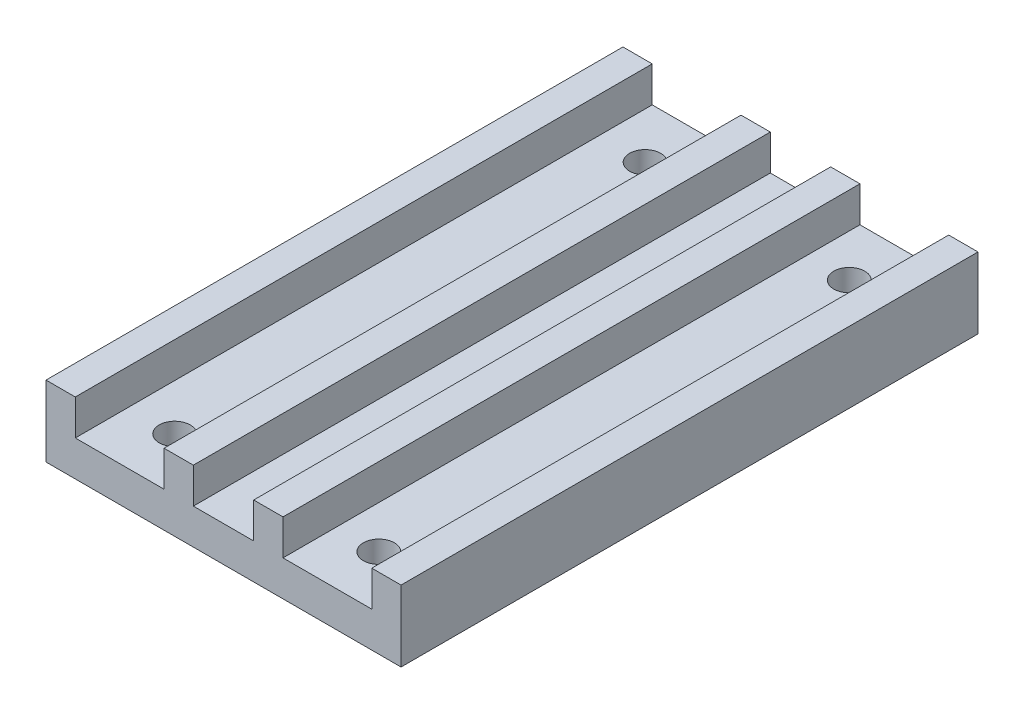
ISO-10303-21;
HEADER;
FILE_DESCRIPTION(('STEP AP214'),'2;1');
FILE_NAME('part.step','',(''),(''),'','','');
FILE_SCHEMA(('AUTOMOTIVE_DESIGN { 1 0 10303 214 1 1 1 1 }'));
ENDSEC;
DATA;
#1=APPLICATION_CONTEXT('core data for automotive mechanical design processes');
#2=APPLICATION_PROTOCOL_DEFINITION('international standard','automotive_design',2000,#1);
#3=PRODUCT_CONTEXT('',#1,'mechanical');
#4=PRODUCT('Part','Part','',(#3));
#5=PRODUCT_RELATED_PRODUCT_CATEGORY('part','',(#4));
#6=PRODUCT_DEFINITION_FORMATION('','',#4);
#7=PRODUCT_DEFINITION_CONTEXT('part definition',#1,'design');
#8=PRODUCT_DEFINITION('design','',#6,#7);
#9=PRODUCT_DEFINITION_SHAPE('','',#8);
#10=(LENGTH_UNIT() NAMED_UNIT(*) SI_UNIT(.MILLI.,.METRE.));
#11=(NAMED_UNIT(*) PLANE_ANGLE_UNIT() SI_UNIT($,.RADIAN.));
#12=(NAMED_UNIT(*) SI_UNIT($,.STERADIAN.) SOLID_ANGLE_UNIT());
#13=UNCERTAINTY_MEASURE_WITH_UNIT(LENGTH_MEASURE(1.E-05),#10,'distance_accuracy_value','');
#14=(GEOMETRIC_REPRESENTATION_CONTEXT(3) GLOBAL_UNCERTAINTY_ASSIGNED_CONTEXT((#13)) GLOBAL_UNIT_ASSIGNED_CONTEXT((#10,
#11,#12)) REPRESENTATION_CONTEXT('',''));
#15=CARTESIAN_POINT('',(0.,0.,0.));
#16=DIRECTION('',(0.,0.,1.));
#17=DIRECTION('',(1.,0.,0.));
#18=AXIS2_PLACEMENT_3D('',#15,#16,#17);
#19=CARTESIAN_POINT('',(0.,4.,0.));
#20=DIRECTION('',(0.,-1.,0.));
#21=DIRECTION('',(0.,0.,-1.));
#22=AXIS2_PLACEMENT_3D('',#19,#20,#21);
#23=PLANE('',#22);
#24=DIRECTION('',(0.,0.,1.));
#25=VECTOR('',#24,1.);
#26=CARTESIAN_POINT('',(3.4,4.,-32.5));
#27=LINE('',#26,#25);
#28=CARTESIAN_POINT('',(3.4,4.,-32.5));
#29=VERTEX_POINT('',#28);
#30=CARTESIAN_POINT('',(3.4,4.,32.5));
#31=VERTEX_POINT('',#30);
#32=EDGE_CURVE('E55',#29,#31,#27,.T.);
#33=ORIENTED_EDGE('',*,*,#32,.F.);
#34=DIRECTION('',(-1.,0.,0.));
#35=VECTOR('',#34,1.);
#36=CARTESIAN_POINT('',(-20.,4.,-32.5));
#37=LINE('',#36,#35);
#38=CARTESIAN_POINT('',(-3.39999999999999,4.,-32.5));
#39=VERTEX_POINT('',#38);
#40=EDGE_CURVE('E310',#29,#39,#37,.T.);
#41=ORIENTED_EDGE('',*,*,#40,.T.);
#42=DIRECTION('',(0.,0.,-1.));
#43=VECTOR('',#42,1.);
#44=CARTESIAN_POINT('',(-3.4,4.,-32.5));
#45=LINE('',#44,#43);
#46=CARTESIAN_POINT('',(-3.39999999999999,4.,32.5));
#47=VERTEX_POINT('',#46);
#48=EDGE_CURVE('E184',#47,#39,#45,.T.);
#49=ORIENTED_EDGE('',*,*,#48,.F.);
#50=DIRECTION('',(1.,0.,0.));
#51=VECTOR('',#50,1.);
#52=CARTESIAN_POINT('',(-20.,4.,32.5));
#53=LINE('',#52,#51);
#54=EDGE_CURVE('E316',#47,#31,#53,.T.);
#55=ORIENTED_EDGE('',*,*,#54,.T.);
#56=EDGE_LOOP('',(#33,#41,#49,#55));
#57=FACE_BOUND('',#56,.T.);
#58=ADVANCED_FACE('F39',(#57),#23,.F.);
#59=CARTESIAN_POINT('',(11.5,4.,26.5));
#60=DIRECTION('',(0.,1.,0.));
#61=DIRECTION('',(0.,0.,1.));
#62=AXIS2_PLACEMENT_3D('',#59,#60,#61);
#63=CIRCLE('',#62,1.75);
#64=CARTESIAN_POINT('',(11.5,4.,28.25));
#65=VERTEX_POINT('',#64);
#66=EDGE_CURVE('E299',#65,#65,#63,.T.);
#67=ORIENTED_EDGE('',*,*,#66,.F.);
#68=EDGE_LOOP('',(#67));
#69=FACE_BOUND('',#68,.T.);
#70=CARTESIAN_POINT('',(11.5,4.,-26.5));
#71=DIRECTION('',(0.,1.,0.));
#72=DIRECTION('',(0.,0.,-1.));
#73=AXIS2_PLACEMENT_3D('',#70,#71,#72);
#74=CIRCLE('',#73,1.75);
#75=CARTESIAN_POINT('',(11.5,4.,-28.25));
#76=VERTEX_POINT('',#75);
#77=EDGE_CURVE('E283',#76,#76,#74,.T.);
#78=ORIENTED_EDGE('',*,*,#77,.F.);
#79=EDGE_LOOP('',(#78));
#80=FACE_BOUND('',#79,.T.);
#81=DIRECTION('',(0.,0.,-1.));
#82=VECTOR('',#81,1.);
#83=CARTESIAN_POINT('',(6.7,4.,-32.5));
#84=LINE('',#83,#82);
#85=CARTESIAN_POINT('',(6.70000000000001,4.,32.5));
#86=VERTEX_POINT('',#85);
#87=CARTESIAN_POINT('',(6.70000000000001,4.,-32.5));
#88=VERTEX_POINT('',#87);
#89=EDGE_CURVE('E175',#86,#88,#84,.T.);
#90=ORIENTED_EDGE('',*,*,#89,.F.);
#91=CARTESIAN_POINT('',(16.7,4.,32.5));
#92=VERTEX_POINT('',#91);
#93=EDGE_CURVE('E309',#86,#92,#53,.T.);
#94=ORIENTED_EDGE('',*,*,#93,.T.);
#95=DIRECTION('',(0.,0.,1.));
#96=VECTOR('',#95,1.);
#97=CARTESIAN_POINT('',(16.7,4.,-32.5));
#98=LINE('',#97,#96);
#99=CARTESIAN_POINT('',(16.7,4.,-32.5));
#100=VERTEX_POINT('',#99);
#101=EDGE_CURVE('E222',#100,#92,#98,.T.);
#102=ORIENTED_EDGE('',*,*,#101,.F.);
#103=EDGE_CURVE('E63',#100,#88,#37,.T.);
#104=ORIENTED_EDGE('',*,*,#103,.T.);
#105=EDGE_LOOP('',(#90,#94,#102,#104));
#106=FACE_BOUND('',#105,.T.);
#107=ADVANCED_FACE('F360',(#69,#80,#106),#23,.F.);
#108=CARTESIAN_POINT('',(-11.5,4.,-26.5));
#109=DIRECTION('',(0.,1.,0.));
#110=DIRECTION('',(0.,0.,1.));
#111=AXIS2_PLACEMENT_3D('',#108,#109,#110);
#112=CIRCLE('',#111,1.75);
#113=CARTESIAN_POINT('',(-11.5,4.,-24.75));
#114=VERTEX_POINT('',#113);
#115=EDGE_CURVE('E275',#114,#114,#112,.T.);
#116=ORIENTED_EDGE('',*,*,#115,.F.);
#117=EDGE_LOOP('',(#116));
#118=FACE_BOUND('',#117,.T.);
#119=CARTESIAN_POINT('',(-11.5,4.,26.5));
#120=DIRECTION('',(0.,1.,0.));
#121=DIRECTION('',(0.,0.,-1.));
#122=AXIS2_PLACEMENT_3D('',#119,#120,#121);
#123=CIRCLE('',#122,1.75);
#124=CARTESIAN_POINT('',(-11.5,4.,24.75));
#125=VERTEX_POINT('',#124);
#126=EDGE_CURVE('E291',#125,#125,#123,.T.);
#127=ORIENTED_EDGE('',*,*,#126,.F.);
#128=EDGE_LOOP('',(#127));
#129=FACE_BOUND('',#128,.T.);
#130=DIRECTION('',(0.,0.,1.));
#131=VECTOR('',#130,1.);
#132=CARTESIAN_POINT('',(-6.7,4.,-32.5));
#133=LINE('',#132,#131);
#134=CARTESIAN_POINT('',(-6.7,4.,-32.5));
#135=VERTEX_POINT('',#134);
#136=CARTESIAN_POINT('',(-6.7,4.,32.5));
#137=VERTEX_POINT('',#136);
#138=EDGE_CURVE('E179',#135,#137,#133,.T.);
#139=ORIENTED_EDGE('',*,*,#138,.F.);
#140=CARTESIAN_POINT('',(-16.7,4.,-32.5));
#141=VERTEX_POINT('',#140);
#142=EDGE_CURVE('E311',#135,#141,#37,.T.);
#143=ORIENTED_EDGE('',*,*,#142,.T.);
#144=DIRECTION('',(0.,0.,-1.));
#145=VECTOR('',#144,1.);
#146=CARTESIAN_POINT('',(-16.7,4.,-32.5));
#147=LINE('',#146,#145);
#148=CARTESIAN_POINT('',(-16.7,4.,32.5));
#149=VERTEX_POINT('',#148);
#150=EDGE_CURVE('E248',#149,#141,#147,.T.);
#151=ORIENTED_EDGE('',*,*,#150,.F.);
#152=EDGE_CURVE('E312',#149,#137,#53,.T.);
#153=ORIENTED_EDGE('',*,*,#152,.T.);
#154=EDGE_LOOP('',(#139,#143,#151,#153));
#155=FACE_BOUND('',#154,.T.);
#156=ADVANCED_FACE('F389',(#118,#129,#155),#23,.F.);
#157=CARTESIAN_POINT('',(0.,0.,0.));
#158=DIRECTION('',(0.,-1.,0.));
#159=DIRECTION('',(0.,0.,-1.));
#160=AXIS2_PLACEMENT_3D('',#157,#158,#159);
#161=PLANE('',#160);
#162=CARTESIAN_POINT('',(11.5,0.,-26.5));
#163=DIRECTION('',(0.,1.,0.));
#164=DIRECTION('',(0.,0.,-1.));
#165=AXIS2_PLACEMENT_3D('',#162,#163,#164);
#166=CIRCLE('',#165,1.75);
#167=CARTESIAN_POINT('',(11.5,0.,-28.25));
#168=VERTEX_POINT('',#167);
#169=EDGE_CURVE('E279',#168,#168,#166,.T.);
#170=ORIENTED_EDGE('',*,*,#169,.T.);
#171=EDGE_LOOP('',(#170));
#172=FACE_BOUND('',#171,.T.);
#173=CARTESIAN_POINT('',(11.5,0.,26.5));
#174=DIRECTION('',(0.,1.,0.));
#175=DIRECTION('',(0.,0.,1.));
#176=AXIS2_PLACEMENT_3D('',#173,#174,#175);
#177=CIRCLE('',#176,1.75);
#178=CARTESIAN_POINT('',(11.5,0.,28.25));
#179=VERTEX_POINT('',#178);
#180=EDGE_CURVE('E295',#179,#179,#177,.T.);
#181=ORIENTED_EDGE('',*,*,#180,.T.);
#182=EDGE_LOOP('',(#181));
#183=FACE_BOUND('',#182,.T.);
#184=DIRECTION('',(0.,0.,-1.));
#185=VECTOR('',#184,1.);
#186=CARTESIAN_POINT('',(20.,0.,32.5));
#187=LINE('',#186,#185);
#188=CARTESIAN_POINT('',(20.,0.,32.5));
#189=VERTEX_POINT('',#188);
#190=CARTESIAN_POINT('',(20.,0.,-32.5));
#191=VERTEX_POINT('',#190);
#192=EDGE_CURVE('E303',#189,#191,#187,.T.);
#193=ORIENTED_EDGE('',*,*,#192,.F.);
#194=DIRECTION('',(1.,0.,0.));
#195=VECTOR('',#194,1.);
#196=CARTESIAN_POINT('',(-20.,0.,32.5));
#197=LINE('',#196,#195);
#198=CARTESIAN_POINT('',(-20.,0.,32.5));
#199=VERTEX_POINT('',#198);
#200=EDGE_CURVE('E326',#199,#189,#197,.T.);
#201=ORIENTED_EDGE('',*,*,#200,.F.);
#202=DIRECTION('',(0.,0.,1.));
#203=VECTOR('',#202,1.);
#204=CARTESIAN_POINT('',(-20.,0.,32.5));
#205=LINE('',#204,#203);
#206=CARTESIAN_POINT('',(-20.,0.,-32.5));
#207=VERTEX_POINT('',#206);
#208=EDGE_CURVE('E323',#207,#199,#205,.T.);
#209=ORIENTED_EDGE('',*,*,#208,.F.);
#210=DIRECTION('',(-1.,0.,0.));
#211=VECTOR('',#210,1.);
#212=CARTESIAN_POINT('',(-20.,0.,-32.5));
#213=LINE('',#212,#211);
#214=EDGE_CURVE('E320',#191,#207,#213,.T.);
#215=ORIENTED_EDGE('',*,*,#214,.F.);
#216=EDGE_LOOP('',(#193,#201,#209,#215));
#217=FACE_BOUND('',#216,.T.);
#218=CARTESIAN_POINT('',(-11.5,0.,26.5));
#219=DIRECTION('',(0.,1.,0.));
#220=DIRECTION('',(0.,0.,-1.));
#221=AXIS2_PLACEMENT_3D('',#218,#219,#220);
#222=CIRCLE('',#221,1.75);
#223=CARTESIAN_POINT('',(-11.5,0.,24.75));
#224=VERTEX_POINT('',#223);
#225=EDGE_CURVE('E287',#224,#224,#222,.T.);
#226=ORIENTED_EDGE('',*,*,#225,.T.);
#227=EDGE_LOOP('',(#226));
#228=FACE_BOUND('',#227,.T.);
#229=CARTESIAN_POINT('',(-11.5,0.,-26.5));
#230=DIRECTION('',(0.,1.,0.));
#231=DIRECTION('',(0.,0.,1.));
#232=AXIS2_PLACEMENT_3D('',#229,#230,#231);
#233=CIRCLE('',#232,1.75);
#234=CARTESIAN_POINT('',(-11.5,0.,-24.75));
#235=VERTEX_POINT('',#234);
#236=EDGE_CURVE('E274',#235,#235,#233,.T.);
#237=ORIENTED_EDGE('',*,*,#236,.T.);
#238=EDGE_LOOP('',(#237));
#239=FACE_BOUND('',#238,.T.);
#240=ADVANCED_FACE('F346',(#172,#183,#217,#228,#239),#161,.T.);
#241=CARTESIAN_POINT('',(20.,4.,32.5));
#242=DIRECTION('',(-1.,0.,0.));
#243=DIRECTION('',(0.,0.,1.));
#244=AXIS2_PLACEMENT_3D('',#241,#242,#243);
#245=PLANE('',#244);
#246=ORIENTED_EDGE('',*,*,#192,.T.);
#247=DIRECTION('',(0.,-1.,0.));
#248=VECTOR('',#247,1.);
#249=CARTESIAN_POINT('',(20.,4.,-32.5));
#250=LINE('',#249,#248);
#251=CARTESIAN_POINT('',(20.,8.,-32.5));
#252=VERTEX_POINT('',#251);
#253=EDGE_CURVE('E11',#252,#191,#250,.T.);
#254=ORIENTED_EDGE('',*,*,#253,.F.);
#255=DIRECTION('',(0.,0.,-1.));
#256=VECTOR('',#255,1.);
#257=CARTESIAN_POINT('',(20.,8.,-32.5));
#258=LINE('',#257,#256);
#259=CARTESIAN_POINT('',(20.,8.,32.5));
#260=VERTEX_POINT('',#259);
#261=EDGE_CURVE('E223',#260,#252,#258,.T.);
#262=ORIENTED_EDGE('',*,*,#261,.F.);
#263=DIRECTION('',(0.,-1.,0.));
#264=VECTOR('',#263,1.);
#265=CARTESIAN_POINT('',(20.,4.,32.5));
#266=LINE('',#265,#264);
#267=EDGE_CURVE('E315',#260,#189,#266,.T.);
#268=ORIENTED_EDGE('',*,*,#267,.T.);
#269=EDGE_LOOP('',(#246,#254,#262,#268));
#270=FACE_BOUND('',#269,.T.);
#271=ADVANCED_FACE('F41',(#270),#245,.F.);
#272=CARTESIAN_POINT('',(-20.,4.,-32.5));
#273=DIRECTION('',(0.,0.,1.));
#274=DIRECTION('',(1.,0.,0.));
#275=AXIS2_PLACEMENT_3D('',#272,#273,#274);
#276=PLANE('',#275);
#277=ORIENTED_EDGE('',*,*,#214,.T.);
#278=DIRECTION('',(0.,-1.,0.));
#279=VECTOR('',#278,1.);
#280=CARTESIAN_POINT('',(-20.,4.,-32.5));
#281=LINE('',#280,#279);
#282=CARTESIAN_POINT('',(-20.,8.,-32.5));
#283=VERTEX_POINT('',#282);
#284=EDGE_CURVE('E48',#283,#207,#281,.T.);
#285=ORIENTED_EDGE('',*,*,#284,.F.);
#286=DIRECTION('',(-1.,0.,0.));
#287=VECTOR('',#286,1.);
#288=CARTESIAN_POINT('',(-20.,8.,-32.5));
#289=LINE('',#288,#287);
#290=CARTESIAN_POINT('',(-16.7,8.,-32.5));
#291=VERTEX_POINT('',#290);
#292=EDGE_CURVE('E259',#291,#283,#289,.T.);
#293=ORIENTED_EDGE('',*,*,#292,.F.);
#294=DIRECTION('',(0.,-1.,0.));
#295=VECTOR('',#294,1.);
#296=CARTESIAN_POINT('',(-16.7,8.,-32.5));
#297=LINE('',#296,#295);
#298=EDGE_CURVE('E263',#291,#141,#297,.T.);
#299=ORIENTED_EDGE('',*,*,#298,.T.);
#300=ORIENTED_EDGE('',*,*,#142,.F.);
#301=DIRECTION('',(0.,-1.,0.));
#302=VECTOR('',#301,1.);
#303=CARTESIAN_POINT('',(-6.7,8.,-32.5));
#304=LINE('',#303,#302);
#305=CARTESIAN_POINT('',(-6.7,8.,-32.5));
#306=VERTEX_POINT('',#305);
#307=EDGE_CURVE('E202',#306,#135,#304,.T.);
#308=ORIENTED_EDGE('',*,*,#307,.F.);
#309=DIRECTION('',(-1.,0.,0.));
#310=VECTOR('',#309,1.);
#311=CARTESIAN_POINT('',(-6.7,8.,-32.5));
#312=LINE('',#311,#310);
#313=CARTESIAN_POINT('',(-3.4,8.,-32.5));
#314=VERTEX_POINT('',#313);
#315=EDGE_CURVE('E200',#314,#306,#312,.T.);
#316=ORIENTED_EDGE('',*,*,#315,.F.);
#317=DIRECTION('',(0.,-1.,0.));
#318=VECTOR('',#317,1.);
#319=CARTESIAN_POINT('',(-3.4,8.,-32.5));
#320=LINE('',#319,#318);
#321=EDGE_CURVE('E210',#314,#39,#320,.T.);
#322=ORIENTED_EDGE('',*,*,#321,.T.);
#323=ORIENTED_EDGE('',*,*,#40,.F.);
#324=DIRECTION('',(0.,-1.,0.));
#325=VECTOR('',#324,1.);
#326=CARTESIAN_POINT('',(3.4,8.,-32.5));
#327=LINE('',#326,#325);
#328=CARTESIAN_POINT('',(3.4,8.,-32.5));
#329=VERTEX_POINT('',#328);
#330=EDGE_CURVE('E366',#329,#29,#327,.T.);
#331=ORIENTED_EDGE('',*,*,#330,.F.);
#332=DIRECTION('',(-1.,0.,0.));
#333=VECTOR('',#332,1.);
#334=CARTESIAN_POINT('',(3.4,8.,-32.5));
#335=LINE('',#334,#333);
#336=CARTESIAN_POINT('',(6.7,8.,-32.5));
#337=VERTEX_POINT('',#336);
#338=EDGE_CURVE('E170',#337,#329,#335,.T.);
#339=ORIENTED_EDGE('',*,*,#338,.F.);
#340=DIRECTION('',(0.,-1.,0.));
#341=VECTOR('',#340,1.);
#342=CARTESIAN_POINT('',(6.7,8.,-32.5));
#343=LINE('',#342,#341);
#344=EDGE_CURVE('E186',#337,#88,#343,.T.);
#345=ORIENTED_EDGE('',*,*,#344,.T.);
#346=ORIENTED_EDGE('',*,*,#103,.F.);
#347=DIRECTION('',(0.,-1.,0.));
#348=VECTOR('',#347,1.);
#349=CARTESIAN_POINT('',(16.7,8.,-32.5));
#350=LINE('',#349,#348);
#351=CARTESIAN_POINT('',(16.7,8.,-32.5));
#352=VERTEX_POINT('',#351);
#353=EDGE_CURVE('E244',#352,#100,#350,.T.);
#354=ORIENTED_EDGE('',*,*,#353,.F.);
#355=DIRECTION('',(-1.,0.,0.));
#356=VECTOR('',#355,1.);
#357=CARTESIAN_POINT('',(20.,8.,-32.5));
#358=LINE('',#357,#356);
#359=EDGE_CURVE('E227',#252,#352,#358,.T.);
#360=ORIENTED_EDGE('',*,*,#359,.F.);
#361=ORIENTED_EDGE('',*,*,#253,.T.);
#362=EDGE_LOOP('',(#277,#285,#293,#299,#300,#308,#316,#322,#323,#331,#339,#345,#346,#354,#360,#361));
#363=FACE_BOUND('',#362,.T.);
#364=ADVANCED_FACE('F362',(#363),#276,.F.);
#365=CARTESIAN_POINT('',(-20.,4.,32.5));
#366=DIRECTION('',(1.,0.,0.));
#367=DIRECTION('',(0.,0.,-1.));
#368=AXIS2_PLACEMENT_3D('',#365,#366,#367);
#369=PLANE('',#368);
#370=ORIENTED_EDGE('',*,*,#208,.T.);
#371=DIRECTION('',(0.,-1.,0.));
#372=VECTOR('',#371,1.);
#373=CARTESIAN_POINT('',(-20.,4.,32.5));
#374=LINE('',#373,#372);
#375=CARTESIAN_POINT('',(-20.,8.,32.5));
#376=VERTEX_POINT('',#375);
#377=EDGE_CURVE('E332',#376,#199,#374,.T.);
#378=ORIENTED_EDGE('',*,*,#377,.F.);
#379=DIRECTION('',(0.,0.,1.));
#380=VECTOR('',#379,1.);
#381=CARTESIAN_POINT('',(-20.,8.,-32.5));
#382=LINE('',#381,#380);
#383=EDGE_CURVE('E249',#283,#376,#382,.T.);
#384=ORIENTED_EDGE('',*,*,#383,.F.);
#385=ORIENTED_EDGE('',*,*,#284,.T.);
#386=EDGE_LOOP('',(#370,#378,#384,#385));
#387=FACE_BOUND('',#386,.T.);
#388=ADVANCED_FACE('F340',(#387),#369,.F.);
#389=CARTESIAN_POINT('',(-20.,4.,32.5));
#390=DIRECTION('',(0.,0.,-1.));
#391=DIRECTION('',(-1.,0.,0.));
#392=AXIS2_PLACEMENT_3D('',#389,#390,#391);
#393=PLANE('',#392);
#394=ORIENTED_EDGE('',*,*,#200,.T.);
#395=ORIENTED_EDGE('',*,*,#267,.F.);
#396=DIRECTION('',(1.,0.,0.));
#397=VECTOR('',#396,1.);
#398=CARTESIAN_POINT('',(20.,8.,32.5));
#399=LINE('',#398,#397);
#400=CARTESIAN_POINT('',(16.7,8.,32.5));
#401=VERTEX_POINT('',#400);
#402=EDGE_CURVE('E233',#401,#260,#399,.T.);
#403=ORIENTED_EDGE('',*,*,#402,.F.);
#404=DIRECTION('',(0.,-1.,0.));
#405=VECTOR('',#404,1.);
#406=CARTESIAN_POINT('',(16.7,8.,32.5));
#407=LINE('',#406,#405);
#408=EDGE_CURVE('E237',#401,#92,#407,.T.);
#409=ORIENTED_EDGE('',*,*,#408,.T.);
#410=ORIENTED_EDGE('',*,*,#93,.F.);
#411=DIRECTION('',(0.,-1.,0.));
#412=VECTOR('',#411,1.);
#413=CARTESIAN_POINT('',(6.70000000000001,8.,32.5));
#414=LINE('',#413,#412);
#415=CARTESIAN_POINT('',(6.70000000000001,8.,32.5));
#416=VERTEX_POINT('',#415);
#417=EDGE_CURVE('E160',#416,#86,#414,.T.);
#418=ORIENTED_EDGE('',*,*,#417,.F.);
#419=DIRECTION('',(1.,0.,0.));
#420=VECTOR('',#419,1.);
#421=CARTESIAN_POINT('',(3.40000000000001,8.,32.5));
#422=LINE('',#421,#420);
#423=CARTESIAN_POINT('',(3.40000000000001,8.,32.5));
#424=VERTEX_POINT('',#423);
#425=EDGE_CURVE('E154',#424,#416,#422,.T.);
#426=ORIENTED_EDGE('',*,*,#425,.F.);
#427=DIRECTION('',(0.,-1.,0.));
#428=VECTOR('',#427,1.);
#429=CARTESIAN_POINT('',(3.40000000000001,8.,32.5));
#430=LINE('',#429,#428);
#431=EDGE_CURVE('E158',#424,#31,#430,.T.);
#432=ORIENTED_EDGE('',*,*,#431,.T.);
#433=ORIENTED_EDGE('',*,*,#54,.F.);
#434=DIRECTION('',(0.,-1.,0.));
#435=VECTOR('',#434,1.);
#436=CARTESIAN_POINT('',(-3.39999999999999,8.,32.5));
#437=LINE('',#436,#435);
#438=CARTESIAN_POINT('',(-3.39999999999999,8.,32.5));
#439=VERTEX_POINT('',#438);
#440=EDGE_CURVE('E214',#439,#47,#437,.T.);
#441=ORIENTED_EDGE('',*,*,#440,.F.);
#442=DIRECTION('',(1.,0.,0.));
#443=VECTOR('',#442,1.);
#444=CARTESIAN_POINT('',(-6.69999999999999,8.,32.5));
#445=LINE('',#444,#443);
#446=CARTESIAN_POINT('',(-6.69999999999999,8.,32.5));
#447=VERTEX_POINT('',#446);
#448=EDGE_CURVE('E194',#447,#439,#445,.T.);
#449=ORIENTED_EDGE('',*,*,#448,.F.);
#450=DIRECTION('',(0.,-1.,0.));
#451=VECTOR('',#450,1.);
#452=CARTESIAN_POINT('',(-6.69999999999999,8.,32.5));
#453=LINE('',#452,#451);
#454=EDGE_CURVE('E218',#447,#137,#453,.T.);
#455=ORIENTED_EDGE('',*,*,#454,.T.);
#456=ORIENTED_EDGE('',*,*,#152,.F.);
#457=DIRECTION('',(0.,-1.,0.));
#458=VECTOR('',#457,1.);
#459=CARTESIAN_POINT('',(-16.7,8.,32.5));
#460=LINE('',#459,#458);
#461=CARTESIAN_POINT('',(-16.7,8.,32.5));
#462=VERTEX_POINT('',#461);
#463=EDGE_CURVE('E270',#462,#149,#460,.T.);
#464=ORIENTED_EDGE('',*,*,#463,.F.);
#465=DIRECTION('',(1.,0.,0.));
#466=VECTOR('',#465,1.);
#467=CARTESIAN_POINT('',(-20.,8.,32.5));
#468=LINE('',#467,#466);
#469=EDGE_CURVE('E253',#376,#462,#468,.T.);
#470=ORIENTED_EDGE('',*,*,#469,.F.);
#471=ORIENTED_EDGE('',*,*,#377,.T.);
#472=EDGE_LOOP('',(#394,#395,#403,#409,#410,#418,#426,#432,#433,#441,#449,#455,#456,#464,#470,#471));
#473=FACE_BOUND('',#472,.T.);
#474=ADVANCED_FACE('F156',(#473),#393,.F.);
#475=CARTESIAN_POINT('',(11.5,4.,26.5));
#476=DIRECTION('',(0.,-1.,0.));
#477=DIRECTION('',(0.,0.,-1.));
#478=AXIS2_PLACEMENT_3D('',#475,#476,#477);
#479=CYLINDRICAL_SURFACE('',#478,1.75);
#480=ORIENTED_EDGE('',*,*,#66,.T.);
#481=EDGE_LOOP('',(#480));
#482=FACE_BOUND('',#481,.T.);
#483=ORIENTED_EDGE('',*,*,#180,.F.);
#484=EDGE_LOOP('',(#483));
#485=FACE_BOUND('',#484,.T.);
#486=ADVANCED_FACE('F454',(#482,#485),#479,.F.);
#487=CARTESIAN_POINT('',(-11.5,4.,26.5));
#488=DIRECTION('',(0.,-1.,0.));
#489=DIRECTION('',(0.,0.,-1.));
#490=AXIS2_PLACEMENT_3D('',#487,#488,#489);
#491=CYLINDRICAL_SURFACE('',#490,1.75);
#492=ORIENTED_EDGE('',*,*,#126,.T.);
#493=EDGE_LOOP('',(#492));
#494=FACE_BOUND('',#493,.T.);
#495=ORIENTED_EDGE('',*,*,#225,.F.);
#496=EDGE_LOOP('',(#495));
#497=FACE_BOUND('',#496,.T.);
#498=ADVANCED_FACE('F451',(#494,#497),#491,.F.);
#499=CARTESIAN_POINT('',(11.5,4.,-26.5));
#500=DIRECTION('',(0.,-1.,0.));
#501=DIRECTION('',(0.,0.,-1.));
#502=AXIS2_PLACEMENT_3D('',#499,#500,#501);
#503=CYLINDRICAL_SURFACE('',#502,1.75);
#504=ORIENTED_EDGE('',*,*,#77,.T.);
#505=EDGE_LOOP('',(#504));
#506=FACE_BOUND('',#505,.T.);
#507=ORIENTED_EDGE('',*,*,#169,.F.);
#508=EDGE_LOOP('',(#507));
#509=FACE_BOUND('',#508,.T.);
#510=ADVANCED_FACE('F447',(#506,#509),#503,.F.);
#511=CARTESIAN_POINT('',(-11.5,4.,-26.5));
#512=DIRECTION('',(0.,-1.,0.));
#513=DIRECTION('',(0.,0.,-1.));
#514=AXIS2_PLACEMENT_3D('',#511,#512,#513);
#515=CYLINDRICAL_SURFACE('',#514,1.75);
#516=ORIENTED_EDGE('',*,*,#115,.T.);
#517=EDGE_LOOP('',(#516));
#518=FACE_BOUND('',#517,.T.);
#519=ORIENTED_EDGE('',*,*,#236,.F.);
#520=EDGE_LOOP('',(#519));
#521=FACE_BOUND('',#520,.T.);
#522=ADVANCED_FACE('F441',(#518,#521),#515,.F.);
#523=CARTESIAN_POINT('',(-16.7,8.,-32.5));
#524=DIRECTION('',(-1.,0.,0.));
#525=DIRECTION('',(0.,0.,1.));
#526=AXIS2_PLACEMENT_3D('',#523,#524,#525);
#527=PLANE('',#526);
#528=ORIENTED_EDGE('',*,*,#150,.T.);
#529=ORIENTED_EDGE('',*,*,#298,.F.);
#530=DIRECTION('',(0.,0.,-1.));
#531=VECTOR('',#530,1.);
#532=CARTESIAN_POINT('',(-16.7,8.,-32.5));
#533=LINE('',#532,#531);
#534=EDGE_CURVE('E256',#462,#291,#533,.T.);
#535=ORIENTED_EDGE('',*,*,#534,.F.);
#536=ORIENTED_EDGE('',*,*,#463,.T.);
#537=EDGE_LOOP('',(#528,#529,#535,#536));
#538=FACE_BOUND('',#537,.T.);
#539=ADVANCED_FACE('F431',(#538),#527,.F.);
#540=CARTESIAN_POINT('',(0.,8.,0.));
#541=DIRECTION('',(0.,1.,0.));
#542=DIRECTION('',(0.,0.,1.));
#543=AXIS2_PLACEMENT_3D('',#540,#541,#542);
#544=PLANE('',#543);
#545=ORIENTED_EDGE('',*,*,#383,.T.);
#546=ORIENTED_EDGE('',*,*,#469,.T.);
#547=ORIENTED_EDGE('',*,*,#534,.T.);
#548=ORIENTED_EDGE('',*,*,#292,.T.);
#549=EDGE_LOOP('',(#545,#546,#547,#548));
#550=FACE_BOUND('',#549,.T.);
#551=ADVANCED_FACE('F433',(#550),#544,.T.);
#552=CARTESIAN_POINT('',(16.7,8.,-32.5));
#553=DIRECTION('',(1.,0.,0.));
#554=DIRECTION('',(0.,0.,-1.));
#555=AXIS2_PLACEMENT_3D('',#552,#553,#554);
#556=PLANE('',#555);
#557=ORIENTED_EDGE('',*,*,#101,.T.);
#558=ORIENTED_EDGE('',*,*,#408,.F.);
#559=DIRECTION('',(0.,0.,1.));
#560=VECTOR('',#559,1.);
#561=CARTESIAN_POINT('',(16.7,8.,-32.5));
#562=LINE('',#561,#560);
#563=EDGE_CURVE('E230',#352,#401,#562,.T.);
#564=ORIENTED_EDGE('',*,*,#563,.F.);
#565=ORIENTED_EDGE('',*,*,#353,.T.);
#566=EDGE_LOOP('',(#557,#558,#564,#565));
#567=FACE_BOUND('',#566,.T.);
#568=ADVANCED_FACE('F359',(#567),#556,.F.);
#569=CARTESIAN_POINT('',(0.,8.,0.));
#570=DIRECTION('',(0.,-1.,0.));
#571=DIRECTION('',(0.,0.,-1.));
#572=AXIS2_PLACEMENT_3D('',#569,#570,#571);
#573=PLANE('',#572);
#574=ORIENTED_EDGE('',*,*,#261,.T.);
#575=ORIENTED_EDGE('',*,*,#359,.T.);
#576=ORIENTED_EDGE('',*,*,#563,.T.);
#577=ORIENTED_EDGE('',*,*,#402,.T.);
#578=EDGE_LOOP('',(#574,#575,#576,#577));
#579=FACE_BOUND('',#578,.T.);
#580=ADVANCED_FACE('F354',(#579),#573,.F.);
#581=CARTESIAN_POINT('',(-6.7,8.,-32.5));
#582=DIRECTION('',(1.,0.,0.));
#583=DIRECTION('',(0.,0.,-1.));
#584=AXIS2_PLACEMENT_3D('',#581,#582,#583);
#585=PLANE('',#584);
#586=ORIENTED_EDGE('',*,*,#138,.T.);
#587=ORIENTED_EDGE('',*,*,#454,.F.);
#588=DIRECTION('',(0.,0.,1.));
#589=VECTOR('',#588,1.);
#590=CARTESIAN_POINT('',(-6.7,8.,-32.5));
#591=LINE('',#590,#589);
#592=EDGE_CURVE('E190',#306,#447,#591,.T.);
#593=ORIENTED_EDGE('',*,*,#592,.F.);
#594=ORIENTED_EDGE('',*,*,#307,.T.);
#595=EDGE_LOOP('',(#586,#587,#593,#594));
#596=FACE_BOUND('',#595,.T.);
#597=ADVANCED_FACE('F417',(#596),#585,.F.);
#598=CARTESIAN_POINT('',(-3.4,8.,-32.5));
#599=DIRECTION('',(-1.,0.,0.));
#600=DIRECTION('',(0.,0.,1.));
#601=AXIS2_PLACEMENT_3D('',#598,#599,#600);
#602=PLANE('',#601);
#603=ORIENTED_EDGE('',*,*,#48,.T.);
#604=ORIENTED_EDGE('',*,*,#321,.F.);
#605=DIRECTION('',(0.,0.,-1.));
#606=VECTOR('',#605,1.);
#607=CARTESIAN_POINT('',(-3.4,8.,-32.5));
#608=LINE('',#607,#606);
#609=EDGE_CURVE('E197',#439,#314,#608,.T.);
#610=ORIENTED_EDGE('',*,*,#609,.F.);
#611=ORIENTED_EDGE('',*,*,#440,.T.);
#612=EDGE_LOOP('',(#603,#604,#610,#611));
#613=FACE_BOUND('',#612,.T.);
#614=ADVANCED_FACE('F423',(#613),#602,.F.);
#615=CARTESIAN_POINT('',(0.,8.,0.));
#616=DIRECTION('',(0.,1.,0.));
#617=DIRECTION('',(0.,0.,1.));
#618=AXIS2_PLACEMENT_3D('',#615,#616,#617);
#619=PLANE('',#618);
#620=ORIENTED_EDGE('',*,*,#592,.T.);
#621=ORIENTED_EDGE('',*,*,#448,.T.);
#622=ORIENTED_EDGE('',*,*,#609,.T.);
#623=ORIENTED_EDGE('',*,*,#315,.T.);
#624=EDGE_LOOP('',(#620,#621,#622,#623));
#625=FACE_BOUND('',#624,.T.);
#626=ADVANCED_FACE('F385',(#625),#619,.T.);
#627=CARTESIAN_POINT('',(3.4,8.,-32.5));
#628=DIRECTION('',(1.,0.,0.));
#629=DIRECTION('',(0.,0.,-1.));
#630=AXIS2_PLACEMENT_3D('',#627,#628,#629);
#631=PLANE('',#630);
#632=ORIENTED_EDGE('',*,*,#32,.T.);
#633=ORIENTED_EDGE('',*,*,#431,.F.);
#634=DIRECTION('',(0.,0.,1.));
#635=VECTOR('',#634,1.);
#636=CARTESIAN_POINT('',(3.4,8.,-32.5));
#637=LINE('',#636,#635);
#638=EDGE_CURVE('E165',#329,#424,#637,.T.);
#639=ORIENTED_EDGE('',*,*,#638,.F.);
#640=ORIENTED_EDGE('',*,*,#330,.T.);
#641=EDGE_LOOP('',(#632,#633,#639,#640));
#642=FACE_BOUND('',#641,.T.);
#643=ADVANCED_FACE('F177',(#642),#631,.F.);
#644=CARTESIAN_POINT('',(6.7,8.,-32.5));
#645=DIRECTION('',(-1.,0.,0.));
#646=DIRECTION('',(0.,0.,1.));
#647=AXIS2_PLACEMENT_3D('',#644,#645,#646);
#648=PLANE('',#647);
#649=ORIENTED_EDGE('',*,*,#89,.T.);
#650=ORIENTED_EDGE('',*,*,#344,.F.);
#651=DIRECTION('',(0.,0.,-1.));
#652=VECTOR('',#651,1.);
#653=CARTESIAN_POINT('',(6.7,8.,-32.5));
#654=LINE('',#653,#652);
#655=EDGE_CURVE('E164',#416,#337,#654,.T.);
#656=ORIENTED_EDGE('',*,*,#655,.F.);
#657=ORIENTED_EDGE('',*,*,#417,.T.);
#658=EDGE_LOOP('',(#649,#650,#656,#657));
#659=FACE_BOUND('',#658,.T.);
#660=ADVANCED_FACE('F377',(#659),#648,.F.);
#661=CARTESIAN_POINT('',(0.,8.,0.));
#662=DIRECTION('',(0.,1.,0.));
#663=DIRECTION('',(0.,0.,1.));
#664=AXIS2_PLACEMENT_3D('',#661,#662,#663);
#665=PLANE('',#664);
#666=ORIENTED_EDGE('',*,*,#638,.T.);
#667=ORIENTED_EDGE('',*,*,#425,.T.);
#668=ORIENTED_EDGE('',*,*,#655,.T.);
#669=ORIENTED_EDGE('',*,*,#338,.T.);
#670=EDGE_LOOP('',(#666,#667,#668,#669));
#671=FACE_BOUND('',#670,.T.);
#672=ADVANCED_FACE('F168',(#671),#665,.T.);
#673=CLOSED_SHELL('',(#58,#107,#156,#240,#271,#364,#388,#474,#486,#498,#510,#522,#539,#551,#568,
#580,#597,#614,#626,#643,#660,#672));
#674=MANIFOLD_SOLID_BREP('B2',#673);
#675=ADVANCED_BREP_SHAPE_REPRESENTATION('',(#18,#674),#14);
#676=SHAPE_DEFINITION_REPRESENTATION(#9,#675);
ENDSEC;
END-ISO-10303-21;
